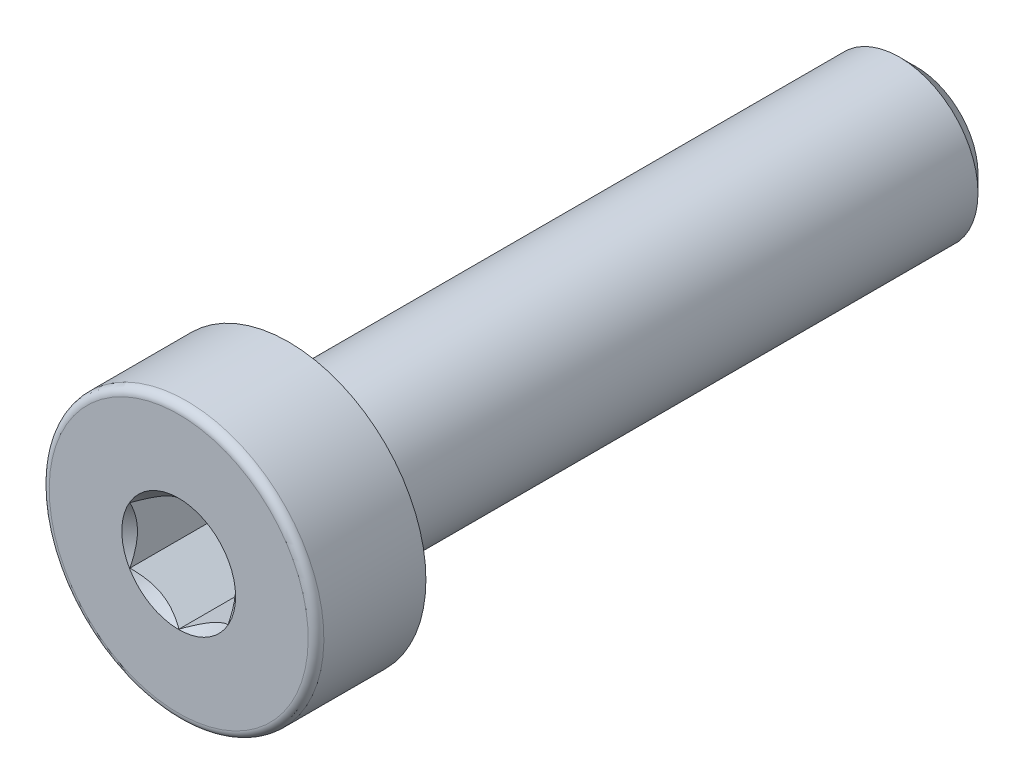
ISO-10303-21;
HEADER;
FILE_DESCRIPTION(('STEP AP214'),'2;1');
FILE_NAME('part.step','',(''),(''),'','','');
FILE_SCHEMA(('AUTOMOTIVE_DESIGN { 1 0 10303 214 1 1 1 1 }'));
ENDSEC;
DATA;
#1=APPLICATION_CONTEXT('core data for automotive mechanical design processes');
#2=APPLICATION_PROTOCOL_DEFINITION('international standard','automotive_design',2000,#1);
#3=PRODUCT_CONTEXT('',#1,'mechanical');
#4=PRODUCT('Part','Part','',(#3));
#5=PRODUCT_RELATED_PRODUCT_CATEGORY('part','',(#4));
#6=PRODUCT_DEFINITION_FORMATION('','',#4);
#7=PRODUCT_DEFINITION_CONTEXT('part definition',#1,'design');
#8=PRODUCT_DEFINITION('design','',#6,#7);
#9=PRODUCT_DEFINITION_SHAPE('','',#8);
#10=(LENGTH_UNIT() NAMED_UNIT(*) SI_UNIT(.MILLI.,.METRE.));
#11=(NAMED_UNIT(*) PLANE_ANGLE_UNIT() SI_UNIT($,.RADIAN.));
#12=(NAMED_UNIT(*) SI_UNIT($,.STERADIAN.) SOLID_ANGLE_UNIT());
#13=UNCERTAINTY_MEASURE_WITH_UNIT(LENGTH_MEASURE(1.E-05),#10,'distance_accuracy_value','');
#14=(GEOMETRIC_REPRESENTATION_CONTEXT(3) GLOBAL_UNCERTAINTY_ASSIGNED_CONTEXT((#13)) GLOBAL_UNIT_ASSIGNED_CONTEXT((#10,
#11,#12)) REPRESENTATION_CONTEXT('',''));
#15=CARTESIAN_POINT('',(0.,0.,0.));
#16=DIRECTION('',(0.,0.,1.));
#17=DIRECTION('',(1.,0.,0.));
#18=AXIS2_PLACEMENT_3D('',#15,#16,#17);
#19=CARTESIAN_POINT('',(-13.4233937586588,6.30662432702593,11.6));
#20=DIRECTION('',(0.500000000000001,-0.866025403784438,0.));
#21=DIRECTION('',(0.866025403784438,0.500000000000001,0.));
#22=AXIS2_PLACEMENT_3D('',#19,#20,#21);
#23=PLANE('',#22);
#24=DIRECTION('',(0.,0.,1.));
#25=VECTOR('',#24,1.);
#26=CARTESIAN_POINT('',(-12.1733937586588,7.02831216351297,11.6));
#27=LINE('',#26,#25);
#28=CARTESIAN_POINT('',(-12.1733936055537,7.02831205156453,11.5933758615089));
#29=VERTEX_POINT('',#28);
#30=CARTESIAN_POINT('',(-12.1733937586588,7.02831216351297,9.3));
#31=VERTEX_POINT('',#30);
#32=EDGE_CURVE('E79',#29,#31,#27,.F.);
#33=ORIENTED_EDGE('',*,*,#32,.T.);
#34=DIRECTION('',(0.866025403784438,0.500000000000001,0.));
#35=VECTOR('',#34,1.);
#36=CARTESIAN_POINT('',(-13.4233937586588,6.30662432702593,9.3));
#37=LINE('',#36,#35);
#38=CARTESIAN_POINT('',(-13.4233937586588,6.30662432702593,9.3));
#39=VERTEX_POINT('',#38);
#40=EDGE_CURVE('E85',#39,#31,#37,.T.);
#41=ORIENTED_EDGE('',*,*,#40,.F.);
#42=DIRECTION('',(0.,0.,1.));
#43=VECTOR('',#42,1.);
#44=CARTESIAN_POINT('',(-13.4233937586588,6.30662432702594,11.6));
#45=LINE('',#44,#43);
#46=CARTESIAN_POINT('',(-13.4233937586632,6.30662432702338,11.5933756729511));
#47=VERTEX_POINT('',#46);
#48=EDGE_CURVE('E82',#39,#47,#45,.T.);
#49=ORIENTED_EDGE('',*,*,#48,.T.);
#50=CARTESIAN_POINT('',(-12.1733937002218,7.02831216779191,11.5933756853364));
#51=CARTESIAN_POINT('',(-12.2163568229737,7.00350741616519,11.5685947292881));
#52=CARTESIAN_POINT('',(-12.2600382863438,6.9782879192839,11.545269439067));
#53=CARTESIAN_POINT('',(-12.3491092672138,6.92686277021083,11.5025618251203));
#54=CARTESIAN_POINT('',(-12.394507250713,6.90065223011473,11.4832032561296));
#55=CARTESIAN_POINT('',(-12.4860500535076,6.84779996676954,11.4500418936151));
#56=CARTESIAN_POINT('',(-12.5321715722449,6.8211716960616,11.4361557728277));
#57=CARTESIAN_POINT('',(-12.6254297159372,6.76732908209256,11.4147615753702));
#58=CARTESIAN_POINT('',(-12.6725634939783,6.74011638249966,11.4072375346617));
#59=CARTESIAN_POINT('',(-12.7538028500107,6.69321281834881,11.4004485004953));
#60=CARTESIAN_POINT('',(-12.7878035860268,6.67358248428071,11.3994438615368));
#61=CARTESIAN_POINT('',(-12.8557452102611,6.63435636925703,11.4011391685542));
#62=CARTESIAN_POINT('',(-12.889686083601,6.61476059689143,11.4038399328628));
#63=CARTESIAN_POINT('',(-12.9572401464571,6.57575824051197,11.4127899225564));
#64=CARTESIAN_POINT('',(-12.9908530016591,6.55635184951456,11.4190424476042));
#65=CARTESIAN_POINT('',(-13.0575175064978,6.51786307970181,11.4347592145059));
#66=CARTESIAN_POINT('',(-13.0905689089223,6.4987808436145,11.4442248344967));
#67=CARTESIAN_POINT('',(-13.1751801962771,6.44993049408318,11.472304007491));
#68=CARTESIAN_POINT('',(-13.2262076401251,6.42046978564168,11.4930250205889));
#69=CARTESIAN_POINT('',(-13.3262661558496,6.36270097465374,11.5396991802517));
#70=CARTESIAN_POINT('',(-13.3753031174996,6.33438947164501,11.5656352949687));
#71=CARTESIAN_POINT('',(-13.4233937586677,6.30662432702081,11.5933756729536));
#72=B_SPLINE_CURVE_WITH_KNOTS('',3,(#50,#51,#52,#53,#54,#55,#56,#57,#58,#59,#60,#61,#62,#63,#64,
#65,#66,#67,#68,#69,#70,#71),.UNSPECIFIED.,.F.,.F.,(4,2,2,2,2,2,2,2,2,2,4),(0.,
0.166478697230875,0.333926955649054,0.498716702198962,0.663091712821197,0.780745635344878,
0.898425545743195,1.01621496255891,1.13405496471272,1.32111597484232,1.50757571067131),.UNSPECIFIED.);
#73=EDGE_CURVE('E76',#29,#47,#72,.T.);
#74=ORIENTED_EDGE('',*,*,#73,.F.);
#75=EDGE_LOOP('',(#33,#41,#49,#74));
#76=FACE_BOUND('',#75,.T.);
#77=ADVANCED_FACE('F16',(#76),#23,.F.);
#78=CARTESIAN_POINT('',(-12.1733937586588,7.02831216351297,11.6));
#79=DIRECTION('',(1.,0.,0.));
#80=DIRECTION('',(0.,1.,0.));
#81=AXIS2_PLACEMENT_3D('',#78,#79,#80);
#82=PLANE('',#81);
#83=DIRECTION('',(0.,0.,1.));
#84=VECTOR('',#83,1.);
#85=CARTESIAN_POINT('',(-12.1733937586588,8.47168783648703,11.6));
#86=LINE('',#85,#84);
#87=CARTESIAN_POINT('',(-12.1733937586544,8.47168783648959,11.5933756729536));
#88=VERTEX_POINT('',#87);
#89=CARTESIAN_POINT('',(-12.1733937586588,8.47168783648703,9.3));
#90=VERTEX_POINT('',#89);
#91=EDGE_CURVE('E162',#88,#90,#86,.F.);
#92=ORIENTED_EDGE('',*,*,#91,.T.);
#93=DIRECTION('',(0.,1.,0.));
#94=VECTOR('',#93,1.);
#95=CARTESIAN_POINT('',(-12.1733937586588,7.02831216351297,9.3));
#96=LINE('',#95,#94);
#97=EDGE_CURVE('E96',#31,#90,#96,.T.);
#98=ORIENTED_EDGE('',*,*,#97,.F.);
#99=ORIENTED_EDGE('',*,*,#32,.F.);
#100=CARTESIAN_POINT('',(-12.1733937586588,8.47168783649727,11.5933756729536));
#101=CARTESIAN_POINT('',(-12.1733937586588,8.42207831192952,11.5685947126506));
#102=CARTESIAN_POINT('',(-12.1733937586588,8.37163931164899,11.5452694223769));
#103=CARTESIAN_POINT('',(-12.1733937586588,8.2687890139366,11.5025618117958));
#104=CARTESIAN_POINT('',(-12.1733937586588,8.21636794078078,11.483203246225));
#105=CARTESIAN_POINT('',(-12.1733937586588,8.11066342503827,11.4500418887989));
#106=CARTESIAN_POINT('',(-12.1733937586588,8.05740688759027,11.4361557696904));
#107=CARTESIAN_POINT('',(-12.1733937586588,7.94972166868708,11.4147615747397));
#108=CARTESIAN_POINT('',(-12.1733937586588,7.89529627456275,11.4072375348733));
#109=CARTESIAN_POINT('',(-12.1733937586588,7.80148915180073,11.4004485007569));
#110=CARTESIAN_POINT('',(-12.1733937586588,7.76222848418028,11.3994438616172));
#111=CARTESIAN_POINT('',(-12.1733937586588,7.68377625518716,11.401139168185));
#112=CARTESIAN_POINT('',(-12.1733937586588,7.64458471099447,11.4038399322248));
#113=CARTESIAN_POINT('',(-12.1733937586588,7.56657999916741,11.4127899213084));
#114=CARTESIAN_POINT('',(-12.1733937586588,7.52776721756702,11.4190424460243));
#115=CARTESIAN_POINT('',(-12.1733937586588,7.4507896787014,11.434759212224));
#116=CARTESIAN_POINT('',(-12.1733937586588,7.41262520689227,11.4442248318446));
#117=CARTESIAN_POINT('',(-12.1733937586588,7.31492449740076,11.4723040071104));
#118=CARTESIAN_POINT('',(-12.1733937586588,7.25600307008844,11.4930250241545));
#119=CARTESIAN_POINT('',(-12.1733937586588,7.140465428185,11.5396991933395));
#120=CARTESIAN_POINT('',(-12.1733937586588,7.08384241266119,11.5656353136128));
#121=CARTESIAN_POINT('',(-12.1733937586588,7.02831211428807,11.5933756975609));
#122=B_SPLINE_CURVE_WITH_KNOTS('',3,(#100,#101,#102,#103,#104,#105,#106,#107,#108,#109,#110,
#111,#112,#113,#114,#115,#116,#117,#118,#119,#120,#121),.UNSPECIFIED.,.F.,.F.,(4,2,2,2,2,2,2,2,
2,2,4),(0.,0.166478683382721,0.333926927146324,0.498716658706512,0.663091654692476,
0.780745575594687,0.898425484357243,1.01621489984313,1.13405490066788,1.32111594407523,
1.50757571256725),.UNSPECIFIED.);
#123=EDGE_CURVE('E88',#88,#29,#122,.T.);
#124=ORIENTED_EDGE('',*,*,#123,.F.);
#125=EDGE_LOOP('',(#92,#98,#99,#124));
#126=FACE_BOUND('',#125,.T.);
#127=ADVANCED_FACE('F98',(#126),#82,.F.);
#128=CARTESIAN_POINT('',(-14.6733937586588,7.02831216351297,11.6));
#129=DIRECTION('',(-0.499999999999999,-0.866025403784439,0.));
#130=DIRECTION('',(0.866025403784439,-0.499999999999999,0.));
#131=AXIS2_PLACEMENT_3D('',#128,#129,#130);
#132=PLANE('',#131);
#133=ORIENTED_EDGE('',*,*,#48,.F.);
#134=DIRECTION('',(0.866025403784436,-0.500000000000004,0.));
#135=VECTOR('',#134,1.);
#136=CARTESIAN_POINT('',(-14.6733937586588,7.02831216351297,9.3));
#137=LINE('',#136,#135);
#138=CARTESIAN_POINT('',(-14.6733937586588,7.02831216351297,9.3));
#139=VERTEX_POINT('',#138);
#140=EDGE_CURVE('E257',#139,#39,#137,.T.);
#141=ORIENTED_EDGE('',*,*,#140,.F.);
#142=DIRECTION('',(0.,0.,1.));
#143=VECTOR('',#142,1.);
#144=CARTESIAN_POINT('',(-14.6733937586588,7.02831216351297,11.6));
#145=LINE('',#144,#143);
#146=CARTESIAN_POINT('',(-14.6733937586632,7.02831216351553,11.5933756729511));
#147=VERTEX_POINT('',#146);
#148=EDGE_CURVE('E249',#139,#147,#145,.T.);
#149=ORIENTED_EDGE('',*,*,#148,.T.);
#150=CARTESIAN_POINT('',(-13.4233937586499,6.30662432702082,11.5933756729536));
#151=CARTESIAN_POINT('',(-13.4663568671591,6.33142908928381,11.5685947126715));
#152=CARTESIAN_POINT('',(-13.510038322706,6.35664858940238,11.5452694224163));
#153=CARTESIAN_POINT('',(-13.5991092932341,6.4080737382138,11.5025618118642));
#154=CARTESIAN_POINT('',(-13.6445072742407,6.43428427476862,11.4832032463041));
#155=CARTESIAN_POINT('',(-13.7360500701639,6.48713653263724,11.4500418888603));
#156=CARTESIAN_POINT('',(-13.7821715845493,6.5137648013831,11.4361557697322));
#157=CARTESIAN_POINT('',(-13.8754297198094,6.56760741087961,11.4147615747526));
#158=CARTESIAN_POINT('',(-13.9225634937719,6.59482010796483,11.4072375348767));
#159=CARTESIAN_POINT('',(-14.0038028451942,6.64172366937726,11.4004485007558));
#160=CARTESIAN_POINT('',(-14.0378035807373,6.66135400319571,11.3994438616164));
#161=CARTESIAN_POINT('',(-14.1057452040574,6.70058011770873,11.401139168188));
#162=CARTESIAN_POINT('',(-14.1396860769561,6.72017588981332,11.4038399322312));
#163=CARTESIAN_POINT('',(-14.2072401390132,6.75917824572686,11.4127899213208));
#164=CARTESIAN_POINT('',(-14.2408529938567,6.778584636519,11.4190424460366));
#165=CARTESIAN_POINT('',(-14.3075174980066,6.81707340593533,11.434759212232));
#166=CARTESIAN_POINT('',(-14.3405689001008,6.83615564183148,11.4442248318486));
#167=CARTESIAN_POINT('',(-14.4251801888192,6.88500599214957,11.4723040045711));
#168=CARTESIAN_POINT('',(-14.4762076343048,6.91446670153672,11.4930250180483));
#169=CARTESIAN_POINT('',(-14.5762661530795,6.97223551428601,11.5396991787867));
#170=CARTESIAN_POINT('',(-14.6253031161464,7.00054701811292,11.5656352941876));
#171=CARTESIAN_POINT('',(-14.6733937586677,7.02831216351809,11.5933756729536));
#172=B_SPLINE_CURVE_WITH_KNOTS('',3,(#150,#151,#152,#153,#154,#155,#156,#157,#158,#159,#160,
#161,#162,#163,#164,#165,#166,#167,#168,#169,#170,#171),.UNSPECIFIED.,.F.,.F.,(4,2,2,2,2,2,2,2,
2,2,4),(0.,0.166478683242098,0.333926926865391,0.49871665856662,0.663091654692315,
0.780745575643616,0.898425484455996,1.01621489989415,1.1340549006677,1.32111591649026,
1.50757565759361),.UNSPECIFIED.);
#173=EDGE_CURVE('E157',#47,#147,#172,.T.);
#174=ORIENTED_EDGE('',*,*,#173,.F.);
#175=EDGE_LOOP('',(#133,#141,#149,#174));
#176=FACE_BOUND('',#175,.T.);
#177=ADVANCED_FACE('F166',(#176),#132,.F.);
#178=CARTESIAN_POINT('',(-12.1733937586588,8.47168783648703,11.6));
#179=DIRECTION('',(0.499999999999999,0.866025403784439,0.));
#180=DIRECTION('',(-0.866025403784439,0.499999999999999,0.));
#181=AXIS2_PLACEMENT_3D('',#178,#179,#180);
#182=PLANE('',#181);
#183=DIRECTION('',(0.,0.,1.));
#184=VECTOR('',#183,1.);
#185=CARTESIAN_POINT('',(-13.4233937586588,9.19337567297406,11.6));
#186=LINE('',#185,#184);
#187=CARTESIAN_POINT('',(-13.4233937586635,9.19337567297677,11.5933756729512));
#188=VERTEX_POINT('',#187);
#189=CARTESIAN_POINT('',(-13.4233937586588,9.19337567297406,9.3));
#190=VERTEX_POINT('',#189);
#191=EDGE_CURVE('E245',#188,#190,#186,.F.);
#192=ORIENTED_EDGE('',*,*,#191,.T.);
#193=DIRECTION('',(-0.86602540378444,0.499999999999998,0.));
#194=VECTOR('',#193,1.);
#195=CARTESIAN_POINT('',(-12.1733937586588,8.47168783648703,9.3));
#196=LINE('',#195,#194);
#197=EDGE_CURVE('E263',#90,#190,#196,.T.);
#198=ORIENTED_EDGE('',*,*,#197,.F.);
#199=ORIENTED_EDGE('',*,*,#91,.F.);
#200=CARTESIAN_POINT('',(-13.4233937586682,9.19337567297947,11.5933756729539));
#201=CARTESIAN_POINT('',(-13.380430650159,9.16857091071646,11.5685947126717));
#202=CARTESIAN_POINT('',(-13.3367491946121,9.14335141059787,11.5452694224165));
#203=CARTESIAN_POINT('',(-13.2476782240839,9.09192626178642,11.5025618118644));
#204=CARTESIAN_POINT('',(-13.2022802430772,9.06571572523158,11.4832032463042));
#205=CARTESIAN_POINT('',(-13.110737447154,9.01286346736292,11.4500418888604));
#206=CARTESIAN_POINT('',(-13.0646159327685,8.98623519861704,11.4361557697323));
#207=CARTESIAN_POINT('',(-12.9713577975084,8.93239258912049,11.4147615747526));
#208=CARTESIAN_POINT('',(-12.9242240235458,8.90517989203525,11.4072375348767));
#209=CARTESIAN_POINT('',(-12.8429846721235,8.85827633062279,11.4004485007558));
#210=CARTESIAN_POINT('',(-12.8089839365804,8.83864599680434,11.3994438616164));
#211=CARTESIAN_POINT('',(-12.7410423132603,8.79941988229132,11.401139168188));
#212=CARTESIAN_POINT('',(-12.7071014403616,8.77982411018673,11.4038399322312));
#213=CARTESIAN_POINT('',(-12.6395473783045,8.74082175427319,11.4127899213208));
#214=CARTESIAN_POINT('',(-12.605934523461,8.72141536348104,11.4190424460365));
#215=CARTESIAN_POINT('',(-12.5392700193111,8.68292659406471,11.434759212232));
#216=CARTESIAN_POINT('',(-12.5062186172169,8.66384435816856,11.4442248318486));
#217=CARTESIAN_POINT('',(-12.4216073284984,8.61499400785046,11.4723040045711));
#218=CARTESIAN_POINT('',(-12.3705798830129,8.58553329846331,11.4930250180483));
#219=CARTESIAN_POINT('',(-12.2705213642381,8.527764485714,11.5396991787867));
#220=CARTESIAN_POINT('',(-12.2214844011712,8.49945298188709,11.5656352941876));
#221=CARTESIAN_POINT('',(-12.1733937586499,8.47168783648191,11.5933756729536));
#222=B_SPLINE_CURVE_WITH_KNOTS('',3,(#200,#201,#202,#203,#204,#205,#206,#207,#208,#209,#210,
#211,#212,#213,#214,#215,#216,#217,#218,#219,#220,#221),.UNSPECIFIED.,.F.,.F.,(4,2,2,2,2,2,2,2,
2,2,4),(0.,0.166478683242229,0.333926926865663,0.498716658567025,0.663091654692854,
0.780745575644159,0.898425484456546,1.0162148998947,1.13405490066826,1.32111591649086,
1.50757565759425),.UNSPECIFIED.);
#223=EDGE_CURVE('E92',#188,#88,#222,.T.);
#224=ORIENTED_EDGE('',*,*,#223,.F.);
#225=EDGE_LOOP('',(#192,#198,#199,#224));
#226=FACE_BOUND('',#225,.T.);
#227=ADVANCED_FACE('F169',(#226),#182,.F.);
#228=CARTESIAN_POINT('',(-13.4233937586588,7.75,9.3));
#229=DIRECTION('',(0.,0.,1.));
#230=DIRECTION('',(1.,0.,0.));
#231=AXIS2_PLACEMENT_3D('',#228,#229,#230);
#232=PLANE('',#231);
#233=DIRECTION('',(0.,-1.,0.));
#234=VECTOR('',#233,1.);
#235=CARTESIAN_POINT('',(-14.6733937586588,8.47168783648703,9.3));
#236=LINE('',#235,#234);
#237=CARTESIAN_POINT('',(-14.6733937586588,8.47168783648703,9.3));
#238=VERTEX_POINT('',#237);
#239=EDGE_CURVE('E252',#238,#139,#236,.T.);
#240=ORIENTED_EDGE('',*,*,#239,.T.);
#241=ORIENTED_EDGE('',*,*,#140,.T.);
#242=ORIENTED_EDGE('',*,*,#40,.T.);
#243=ORIENTED_EDGE('',*,*,#97,.T.);
#244=ORIENTED_EDGE('',*,*,#197,.T.);
#245=DIRECTION('',(-0.866025403784438,-0.500000000000001,0.));
#246=VECTOR('',#245,1.);
#247=CARTESIAN_POINT('',(-13.4233937586588,9.19337567297406,9.3));
#248=LINE('',#247,#246);
#249=EDGE_CURVE('E242',#190,#238,#248,.T.);
#250=ORIENTED_EDGE('',*,*,#249,.T.);
#251=EDGE_LOOP('',(#240,#241,#242,#243,#244,#250));
#252=FACE_BOUND('',#251,.T.);
#253=ADVANCED_FACE('F275',(#252),#232,.T.);
#254=CARTESIAN_POINT('',(-14.6733937586588,8.47168783648703,11.6));
#255=DIRECTION('',(-1.,0.,0.));
#256=DIRECTION('',(0.,-1.,0.));
#257=AXIS2_PLACEMENT_3D('',#254,#255,#256);
#258=PLANE('',#257);
#259=ORIENTED_EDGE('',*,*,#148,.F.);
#260=ORIENTED_EDGE('',*,*,#239,.F.);
#261=DIRECTION('',(0.,0.,1.));
#262=VECTOR('',#261,1.);
#263=CARTESIAN_POINT('',(-14.6733937586588,8.47168783648703,11.6));
#264=LINE('',#263,#262);
#265=CARTESIAN_POINT('',(-14.6733937586261,8.47168783647076,11.5933756728862));
#266=VERTEX_POINT('',#265);
#267=EDGE_CURVE('E130',#238,#266,#264,.T.);
#268=ORIENTED_EDGE('',*,*,#267,.T.);
#269=CARTESIAN_POINT('',(-14.6733937586588,7.02831216350273,11.5933756729536));
#270=CARTESIAN_POINT('',(-14.6733937586588,7.07792168802872,11.5685947126715));
#271=CARTESIAN_POINT('',(-14.6733937586588,7.12836068826585,11.5452694224163));
#272=CARTESIAN_POINT('',(-14.6733937586588,7.23121098588866,11.5025618118643));
#273=CARTESIAN_POINT('',(-14.6733937586588,7.2836320589983,11.4832032463041));
#274=CARTESIAN_POINT('',(-14.6733937586588,7.38933657473553,11.4500418888603));
#275=CARTESIAN_POINT('',(-14.6733937586588,7.44259311222726,11.4361557697322));
#276=CARTESIAN_POINT('',(-14.6733937586588,7.5502783312203,11.4147615747526));
#277=CARTESIAN_POINT('',(-14.6733937586588,7.60470372539074,11.4072375348767));
#278=CARTESIAN_POINT('',(-14.6733937586588,7.69851084821563,11.4004485007558));
#279=CARTESIAN_POINT('',(-14.6733937586588,7.73777151585252,11.3994438616164));
#280=CARTESIAN_POINT('',(-14.6733937586588,7.81622374487857,11.401139168188));
#281=CARTESIAN_POINT('',(-14.6733937586588,7.85541528908775,11.4038399322312));
#282=CARTESIAN_POINT('',(-14.6733937586588,7.93342000091483,11.4127899213209));
#283=CARTESIAN_POINT('',(-14.6733937586588,7.97223278249911,11.4190424460366));
#284=CARTESIAN_POINT('',(-14.6733937586588,8.04921032133176,11.434759212232));
#285=CARTESIAN_POINT('',(-14.6733937586588,8.08737479312407,11.4442248318486));
#286=CARTESIAN_POINT('',(-14.6733937586588,8.18507549375866,11.4723040045707));
#287=CARTESIAN_POINT('',(-14.6733937586588,8.24399691253144,11.4930250180472));
#288=CARTESIAN_POINT('',(-14.6733937586588,8.35953453802709,11.5396991787841));
#289=CARTESIAN_POINT('',(-14.6733937586588,8.41615754567949,11.5656352941842));
#290=CARTESIAN_POINT('',(-14.6733937586588,8.47168783648849,11.5933756729492));
#291=B_SPLINE_CURVE_WITH_KNOTS('',3,(#269,#270,#271,#272,#273,#274,#275,#276,#277,#278,#279,
#280,#281,#282,#283,#284,#285,#286,#287,#288,#289,#290),.UNSPECIFIED.,.F.,.F.,(4,2,2,2,2,2,2,2,
2,2,4),(0.,0.166478683242071,0.33392692686534,0.498716658566594,0.663091654692315,
0.780745575643624,0.898425484456012,1.01621489989415,1.1340549006677,1.32111591648534,
1.50757565758379),.UNSPECIFIED.);
#292=EDGE_CURVE('E131',#147,#266,#291,.T.);
#293=ORIENTED_EDGE('',*,*,#292,.F.);
#294=EDGE_LOOP('',(#259,#260,#268,#293));
#295=FACE_BOUND('',#294,.T.);
#296=ADVANCED_FACE('F281',(#295),#258,.F.);
#297=CARTESIAN_POINT('',(-13.4233937586588,9.19337567297406,11.6));
#298=DIRECTION('',(-0.500000000000001,0.866025403784438,0.));
#299=DIRECTION('',(-0.866025403784438,-0.500000000000001,0.));
#300=AXIS2_PLACEMENT_3D('',#297,#298,#299);
#301=PLANE('',#300);
#302=ORIENTED_EDGE('',*,*,#267,.F.);
#303=ORIENTED_EDGE('',*,*,#249,.F.);
#304=ORIENTED_EDGE('',*,*,#191,.F.);
#305=CARTESIAN_POINT('',(-13.4233937586485,9.19337567297664,11.5933756729552));
#306=CARTESIAN_POINT('',(-13.4663568671582,9.16857091071548,11.5685947126722));
#307=CARTESIAN_POINT('',(-13.5100383227053,9.14335141059769,11.5452694224167));
#308=CARTESIAN_POINT('',(-13.5991092932335,9.09192626178691,11.5025618118645));
#309=CARTESIAN_POINT('',(-13.6445072742399,9.06571572523194,11.4832032463044));
#310=CARTESIAN_POINT('',(-13.7360500701628,9.01286346736328,11.4500418888606));
#311=CARTESIAN_POINT('',(-13.7821715845482,8.98623519861752,11.4361557697325));
#312=CARTESIAN_POINT('',(-13.8754297198081,8.93239258912114,11.4147615747528));
#313=CARTESIAN_POINT('',(-13.9225634937706,8.90517989203595,11.4072375348769));
#314=CARTESIAN_POINT('',(-14.0038028451928,8.85827633062357,11.4004485007558));
#315=CARTESIAN_POINT('',(-14.0378035807358,8.83864599680514,11.3994438616164));
#316=CARTESIAN_POINT('',(-14.1057452040558,8.79941988229216,11.4011391681879));
#317=CARTESIAN_POINT('',(-14.1396860769545,8.77982411018758,11.403839932231));
#318=CARTESIAN_POINT('',(-14.2072401390116,8.74082175427407,11.4127899213206));
#319=CARTESIAN_POINT('',(-14.2408529938551,8.72141536348195,11.4190424460362));
#320=CARTESIAN_POINT('',(-14.3075174980049,8.68292659406565,11.4347592122316));
#321=CARTESIAN_POINT('',(-14.340568900099,8.66384435816951,11.4442248318481));
#322=CARTESIAN_POINT('',(-14.4251801888155,8.61499400785258,11.4723040045698));
#323=CARTESIAN_POINT('',(-14.4762076342991,8.58553329846653,11.493025018046));
#324=CARTESIAN_POINT('',(-14.5762661530702,8.52776448571938,11.5396991787821));
#325=CARTESIAN_POINT('',(-14.6253031161353,8.4994529818935,11.5656352941816));
#326=CARTESIAN_POINT('',(-14.6733937586548,8.47168783648931,11.5933756729462));
#327=B_SPLINE_CURVE_WITH_KNOTS('',3,(#305,#306,#307,#308,#309,#310,#311,#312,#313,#314,#315,
#316,#317,#318,#319,#320,#321,#322,#323,#324,#325,#326),.UNSPECIFIED.,.F.,.F.,(4,2,2,2,2,2,2,2,
2,2,4),(0.,0.166478683241854,0.333926926864846,0.498716658565813,0.663091654691269,
0.780745575642466,0.89842548445474,1.01621489989277,1.13405490066621,1.32111591648153,
1.50757565757767),.UNSPECIFIED.);
#328=EDGE_CURVE('E122',#188,#266,#327,.T.);
#329=ORIENTED_EDGE('',*,*,#328,.T.);
#330=EDGE_LOOP('',(#302,#303,#304,#329));
#331=FACE_BOUND('',#330,.T.);
#332=ADVANCED_FACE('F137',(#331),#301,.F.);
#333=CARTESIAN_POINT('',(-13.4233937586588,7.75,11.5999999998735));
#334=DIRECTION('',(0.,0.,1.));
#335=DIRECTION('',(1.,0.,0.));
#336=AXIS2_PLACEMENT_3D('',#333,#334,#335);
#337=CONICAL_SURFACE('',#336,1.44999999989988,0.785398163459877);
#338=ORIENTED_EDGE('',*,*,#123,.T.);
#339=ORIENTED_EDGE('',*,*,#73,.T.);
#340=ORIENTED_EDGE('',*,*,#173,.T.);
#341=ORIENTED_EDGE('',*,*,#292,.T.);
#342=ORIENTED_EDGE('',*,*,#328,.F.);
#343=ORIENTED_EDGE('',*,*,#223,.T.);
#344=EDGE_LOOP('',(#338,#339,#340,#341,#342,#343));
#345=FACE_BOUND('',#344,.T.);
#346=CARTESIAN_POINT('',(-13.4233937586588,7.75,11.5999999999958));
#347=DIRECTION('',(0.,0.,1.));
#348=DIRECTION('',(1.,0.,0.));
#349=AXIS2_PLACEMENT_3D('',#346,#347,#348);
#350=CIRCLE('',#349,1.45000000002221);
#351=CARTESIAN_POINT('',(-11.9733937586366,7.75,11.5999999999958));
#352=VERTEX_POINT('',#351);
#353=EDGE_CURVE('E119',#352,#352,#350,.F.);
#354=ORIENTED_EDGE('',*,*,#353,.F.);
#355=EDGE_LOOP('',(#354));
#356=FACE_BOUND('',#355,.T.);
#357=ADVANCED_FACE('F89',(#345,#356),#337,.F.);
#358=CARTESIAN_POINT('',(-15.4802040926468,8.9375,11.6));
#359=DIRECTION('',(0.,0.,1.));
#360=DIRECTION('',(1.,0.,0.));
#361=AXIS2_PLACEMENT_3D('',#358,#359,#360);
#362=PLANE('',#361);
#363=CARTESIAN_POINT('',(-13.4233937586588,7.75,11.6));
#364=DIRECTION('',(0.,0.,-1.));
#365=DIRECTION('',(0.866025403784435,-0.500000000000006,0.));
#366=AXIS2_PLACEMENT_3D('',#363,#364,#365);
#367=CIRCLE('',#366,3.29999999999996);
#368=CARTESIAN_POINT('',(-10.5655099261702,6.09999999999998,11.6));
#369=VERTEX_POINT('',#368);
#370=CARTESIAN_POINT('',(-16.2812775911475,9.4,11.6));
#371=VERTEX_POINT('',#370);
#372=EDGE_CURVE('E36',#369,#371,#367,.T.);
#373=ORIENTED_EDGE('',*,*,#372,.F.);
#374=CARTESIAN_POINT('',(-13.4233937586588,7.75,11.6));
#375=DIRECTION('',(0.,0.,-1.));
#376=DIRECTION('',(-0.866025403784439,0.5,0.));
#377=AXIS2_PLACEMENT_3D('',#374,#375,#376);
#378=CIRCLE('',#377,3.30000000000005);
#379=EDGE_CURVE('E223',#371,#369,#378,.T.);
#380=ORIENTED_EDGE('',*,*,#379,.F.);
#381=EDGE_LOOP('',(#373,#380));
#382=FACE_BOUND('',#381,.T.);
#383=ORIENTED_EDGE('',*,*,#353,.T.);
#384=EDGE_LOOP('',(#383));
#385=FACE_BOUND('',#384,.T.);
#386=ADVANCED_FACE('F142',(#382,#385),#362,.T.);
#387=CARTESIAN_POINT('',(-13.4233937586588,7.75,11.4));
#388=DIRECTION('',(0.,0.,1.));
#389=DIRECTION('',(-0.866025403784439,0.499999999999999,0.));
#390=AXIS2_PLACEMENT_3D('',#387,#388,#389);
#391=TOROIDAL_SURFACE('',#390,3.3,0.199999999999999);
#392=ORIENTED_EDGE('',*,*,#372,.T.);
#393=ORIENTED_EDGE('',*,*,#379,.T.);
#394=EDGE_LOOP('',(#392,#393));
#395=FACE_BOUND('',#394,.T.);
#396=CARTESIAN_POINT('',(-13.4233937586588,7.75,11.4));
#397=DIRECTION('',(0.,0.,-1.));
#398=DIRECTION('',(-1.,0.,0.));
#399=AXIS2_PLACEMENT_3D('',#396,#397,#398);
#400=CIRCLE('',#399,3.5);
#401=CARTESIAN_POINT('',(-16.9233937586588,7.75,11.4));
#402=VERTEX_POINT('',#401);
#403=EDGE_CURVE('E118',#402,#402,#400,.T.);
#404=ORIENTED_EDGE('',*,*,#403,.F.);
#405=EDGE_LOOP('',(#404));
#406=FACE_BOUND('',#405,.T.);
#407=ADVANCED_FACE('F202',(#395,#406),#391,.T.);
#408=CARTESIAN_POINT('',(-14.1034402069805,8.142625,-7.2));
#409=DIRECTION('',(0.,0.,-1.));
#410=DIRECTION('',(-1.,0.,0.));
#411=AXIS2_PLACEMENT_3D('',#408,#409,#410);
#412=PLANE('',#411);
#413=CARTESIAN_POINT('',(-13.4233937586588,7.75,-7.20000000001164));
#414=DIRECTION('',(0.,0.,1.));
#415=DIRECTION('',(1.,0.,0.));
#416=AXIS2_PLACEMENT_3D('',#413,#414,#415);
#417=CIRCLE('',#416,1.57050000002239);
#418=CARTESIAN_POINT('',(-11.8528937586364,7.75,-7.20000000001164));
#419=VERTEX_POINT('',#418);
#420=EDGE_CURVE('E115',#419,#419,#417,.T.);
#421=ORIENTED_EDGE('',*,*,#420,.F.);
#422=EDGE_LOOP('',(#421));
#423=FACE_BOUND('',#422,.T.);
#424=ADVANCED_FACE('F199',(#423),#412,.T.);
#425=CARTESIAN_POINT('',(-13.4233937586588,7.75,10.1));
#426=DIRECTION('',(0.,0.,-1.));
#427=DIRECTION('',(-1.,0.,0.));
#428=AXIS2_PLACEMENT_3D('',#425,#426,#427);
#429=CYLINDRICAL_SURFACE('',#428,3.5);
#430=ORIENTED_EDGE('',*,*,#403,.T.);
#431=EDGE_LOOP('',(#430));
#432=FACE_BOUND('',#431,.T.);
#433=CARTESIAN_POINT('',(-13.4233937586588,7.75,8.8));
#434=DIRECTION('',(0.,0.,-1.));
#435=DIRECTION('',(-1.,0.,0.));
#436=AXIS2_PLACEMENT_3D('',#433,#434,#435);
#437=CIRCLE('',#436,3.5);
#438=CARTESIAN_POINT('',(-16.9233937586588,7.75,8.8));
#439=VERTEX_POINT('',#438);
#440=EDGE_CURVE('E112',#439,#439,#437,.T.);
#441=ORIENTED_EDGE('',*,*,#440,.F.);
#442=EDGE_LOOP('',(#441));
#443=FACE_BOUND('',#442,.T.);
#444=ADVANCED_FACE('F195',(#432,#443),#429,.T.);
#445=CARTESIAN_POINT('',(-13.4233937586588,7.75,-6.77050000012969));
#446=DIRECTION('',(0.,0.,1.));
#447=DIRECTION('',(1.,0.,0.));
#448=AXIS2_PLACEMENT_3D('',#445,#446,#447);
#449=CONICAL_SURFACE('',#448,1.99999999987353,0.785398163361583);
#450=ORIENTED_EDGE('',*,*,#420,.T.);
#451=EDGE_LOOP('',(#450));
#452=FACE_BOUND('',#451,.T.);
#453=CARTESIAN_POINT('',(-13.4233937586588,7.75,-6.7705));
#454=DIRECTION('',(0.,0.,-1.));
#455=DIRECTION('',(-1.,0.,0.));
#456=AXIS2_PLACEMENT_3D('',#453,#454,#455);
#457=CIRCLE('',#456,2.);
#458=CARTESIAN_POINT('',(-15.4233937586588,7.75,-6.7705));
#459=VERTEX_POINT('',#458);
#460=EDGE_CURVE('E28',#459,#459,#457,.F.);
#461=ORIENTED_EDGE('',*,*,#460,.F.);
#462=EDGE_LOOP('',(#461));
#463=FACE_BOUND('',#462,.T.);
#464=ADVANCED_FACE('F187',(#452,#463),#449,.T.);
#465=CARTESIAN_POINT('',(-15.804963619066,9.125,8.8));
#466=DIRECTION('',(0.,0.,-1.));
#467=DIRECTION('',(-1.,0.,0.));
#468=AXIS2_PLACEMENT_3D('',#465,#466,#467);
#469=PLANE('',#468);
#470=CARTESIAN_POINT('',(-13.4233937586588,7.75,8.8));
#471=DIRECTION('',(0.,0.,-1.));
#472=DIRECTION('',(-1.,0.,0.));
#473=AXIS2_PLACEMENT_3D('',#470,#471,#472);
#474=CIRCLE('',#473,2.);
#475=CARTESIAN_POINT('',(-15.4233937586588,7.75,8.8));
#476=VERTEX_POINT('',#475);
#477=EDGE_CURVE('E11',#476,#476,#474,.T.);
#478=ORIENTED_EDGE('',*,*,#477,.F.);
#479=EDGE_LOOP('',(#478));
#480=FACE_BOUND('',#479,.T.);
#481=ORIENTED_EDGE('',*,*,#440,.T.);
#482=EDGE_LOOP('',(#481));
#483=FACE_BOUND('',#482,.T.);
#484=ADVANCED_FACE('F181',(#480,#483),#469,.T.);
#485=CARTESIAN_POINT('',(-13.4233937586588,7.75,1.01475));
#486=DIRECTION('',(0.,0.,-1.));
#487=DIRECTION('',(-1.,0.,0.));
#488=AXIS2_PLACEMENT_3D('',#485,#486,#487);
#489=CYLINDRICAL_SURFACE('',#488,2.);
#490=ORIENTED_EDGE('',*,*,#460,.T.);
#491=EDGE_LOOP('',(#490));
#492=FACE_BOUND('',#491,.T.);
#493=ORIENTED_EDGE('',*,*,#477,.T.);
#494=EDGE_LOOP('',(#493));
#495=FACE_BOUND('',#494,.T.);
#496=ADVANCED_FACE('F179',(#492,#495),#489,.T.);
#497=CLOSED_SHELL('',(#77,#127,#177,#227,#253,#296,#332,#357,#386,#407,#424,#444,#464,#484,#496));
#498=MANIFOLD_SOLID_BREP('B1',#497);
#499=ADVANCED_BREP_SHAPE_REPRESENTATION('',(#18,#498),#14);
#500=SHAPE_DEFINITION_REPRESENTATION(#9,#499);
ENDSEC;
END-ISO-10303-21;
